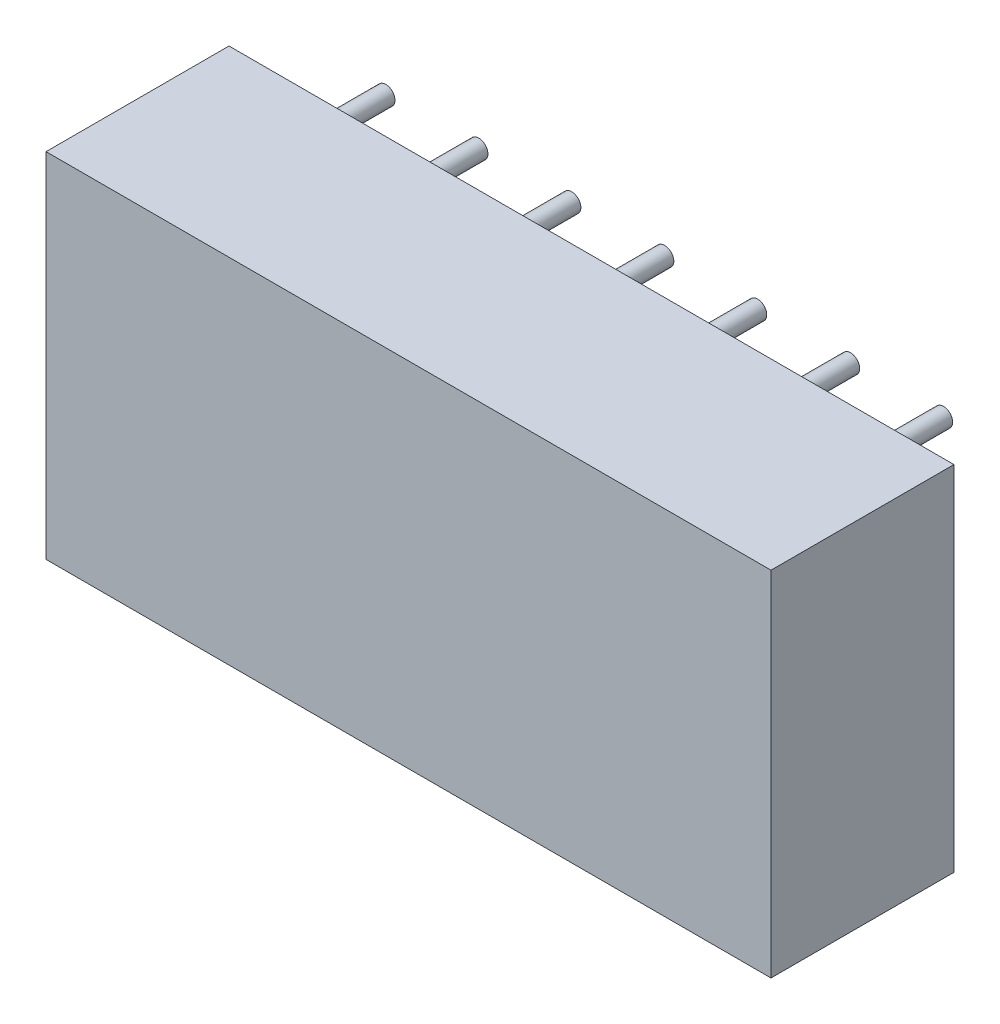
ISO-10303-21;
HEADER;
FILE_DESCRIPTION(('STEP AP214'),'2;1');
FILE_NAME('part.step','',(''),(''),'','','');
FILE_SCHEMA(('AUTOMOTIVE_DESIGN { 1 0 10303 214 1 1 1 1 }'));
ENDSEC;
DATA;
#1=APPLICATION_CONTEXT('core data for automotive mechanical design processes');
#2=APPLICATION_PROTOCOL_DEFINITION('international standard','automotive_design',2000,#1);
#3=PRODUCT_CONTEXT('',#1,'mechanical');
#4=PRODUCT('Part','Part','',(#3));
#5=PRODUCT_RELATED_PRODUCT_CATEGORY('part','',(#4));
#6=PRODUCT_DEFINITION_FORMATION('','',#4);
#7=PRODUCT_DEFINITION_CONTEXT('part definition',#1,'design');
#8=PRODUCT_DEFINITION('design','',#6,#7);
#9=PRODUCT_DEFINITION_SHAPE('','',#8);
#10=(LENGTH_UNIT() NAMED_UNIT(*) SI_UNIT(.MILLI.,.METRE.));
#11=(NAMED_UNIT(*) PLANE_ANGLE_UNIT() SI_UNIT($,.RADIAN.));
#12=(NAMED_UNIT(*) SI_UNIT($,.STERADIAN.) SOLID_ANGLE_UNIT());
#13=UNCERTAINTY_MEASURE_WITH_UNIT(LENGTH_MEASURE(1.E-05),#10,'distance_accuracy_value','');
#14=(GEOMETRIC_REPRESENTATION_CONTEXT(3) GLOBAL_UNCERTAINTY_ASSIGNED_CONTEXT((#13)) GLOBAL_UNIT_ASSIGNED_CONTEXT((#10,
#11,#12)) REPRESENTATION_CONTEXT('',''));
#15=CARTESIAN_POINT('',(0.,0.,0.));
#16=DIRECTION('',(0.,0.,1.));
#17=DIRECTION('',(1.,0.,0.));
#18=AXIS2_PLACEMENT_3D('',#15,#16,#17);
#19=CARTESIAN_POINT('',(0.,7.62,-2.));
#20=DIRECTION('',(0.,0.,1.));
#21=DIRECTION('',(1.,0.,0.));
#22=AXIS2_PLACEMENT_3D('',#19,#20,#21);
#23=CYLINDRICAL_SURFACE('',#22,0.25);
#24=CARTESIAN_POINT('',(0.,7.62,-2.));
#25=DIRECTION('',(0.,0.,1.));
#26=DIRECTION('',(1.,0.,0.));
#27=AXIS2_PLACEMENT_3D('',#24,#25,#26);
#28=CIRCLE('',#27,0.25);
#29=CARTESIAN_POINT('',(0.25,7.62,-2.));
#30=VERTEX_POINT('',#29);
#31=EDGE_CURVE('E11',#30,#30,#28,.T.);
#32=ORIENTED_EDGE('',*,*,#31,.T.);
#33=EDGE_LOOP('',(#32));
#34=FACE_BOUND('',#33,.T.);
#35=CARTESIAN_POINT('',(0.,7.62,0.));
#36=DIRECTION('',(0.,0.,1.));
#37=DIRECTION('',(1.,0.,0.));
#38=AXIS2_PLACEMENT_3D('',#35,#36,#37);
#39=CIRCLE('',#38,0.25);
#40=CARTESIAN_POINT('',(0.25,7.62,0.));
#41=VERTEX_POINT('',#40);
#42=EDGE_CURVE('E43',#41,#41,#39,.T.);
#43=ORIENTED_EDGE('',*,*,#42,.F.);
#44=EDGE_LOOP('',(#43));
#45=FACE_BOUND('',#44,.T.);
#46=ADVANCED_FACE('F40',(#34,#45),#23,.T.);
#47=CARTESIAN_POINT('',(0.,7.62,-2.));
#48=DIRECTION('',(0.,0.,1.));
#49=DIRECTION('',(1.,0.,0.));
#50=AXIS2_PLACEMENT_3D('',#47,#48,#49);
#51=PLANE('',#50);
#52=ORIENTED_EDGE('',*,*,#31,.F.);
#53=EDGE_LOOP('',(#52));
#54=FACE_BOUND('',#53,.T.);
#55=ADVANCED_FACE('F55',(#54),#51,.F.);
#56=CARTESIAN_POINT('',(0.,7.62,0.));
#57=DIRECTION('',(0.,0.,1.));
#58=DIRECTION('',(1.,0.,0.));
#59=AXIS2_PLACEMENT_3D('',#56,#57,#58);
#60=PLANE('',#59);
#61=ORIENTED_EDGE('',*,*,#42,.T.);
#62=EDGE_LOOP('',(#61));
#63=FACE_BOUND('',#62,.T.);
#64=ADVANCED_FACE('F52',(#63),#60,.T.);
#65=CLOSED_SHELL('',(#46,#55,#64));
#66=MANIFOLD_SOLID_BREP('B2',#65);
#67=CARTESIAN_POINT('',(2.54,7.62,-2.));
#68=DIRECTION('',(0.,0.,1.));
#69=DIRECTION('',(1.,0.,0.));
#70=AXIS2_PLACEMENT_3D('',#67,#68,#69);
#71=CYLINDRICAL_SURFACE('',#70,0.25);
#72=CARTESIAN_POINT('',(2.54,7.62,-2.));
#73=DIRECTION('',(0.,0.,1.));
#74=DIRECTION('',(1.,0.,0.));
#75=AXIS2_PLACEMENT_3D('',#72,#73,#74);
#76=CIRCLE('',#75,0.25);
#77=CARTESIAN_POINT('',(2.79,7.62,-2.));
#78=VERTEX_POINT('',#77);
#79=EDGE_CURVE('E39',#78,#78,#76,.T.);
#80=ORIENTED_EDGE('',*,*,#79,.T.);
#81=EDGE_LOOP('',(#80));
#82=FACE_BOUND('',#81,.T.);
#83=CARTESIAN_POINT('',(2.54,7.62,0.));
#84=DIRECTION('',(0.,0.,1.));
#85=DIRECTION('',(1.,0.,0.));
#86=AXIS2_PLACEMENT_3D('',#83,#84,#85);
#87=CIRCLE('',#86,0.25);
#88=CARTESIAN_POINT('',(2.79,7.62,0.));
#89=VERTEX_POINT('',#88);
#90=EDGE_CURVE('E92',#89,#89,#87,.T.);
#91=ORIENTED_EDGE('',*,*,#90,.F.);
#92=EDGE_LOOP('',(#91));
#93=FACE_BOUND('',#92,.T.);
#94=ADVANCED_FACE('F89',(#82,#93),#71,.T.);
#95=CARTESIAN_POINT('',(2.54,7.62,-2.));
#96=DIRECTION('',(0.,0.,1.));
#97=DIRECTION('',(1.,0.,0.));
#98=AXIS2_PLACEMENT_3D('',#95,#96,#97);
#99=PLANE('',#98);
#100=ORIENTED_EDGE('',*,*,#79,.F.);
#101=EDGE_LOOP('',(#100));
#102=FACE_BOUND('',#101,.T.);
#103=ADVANCED_FACE('F104',(#102),#99,.F.);
#104=CARTESIAN_POINT('',(2.54,7.62,0.));
#105=DIRECTION('',(0.,0.,1.));
#106=DIRECTION('',(1.,0.,0.));
#107=AXIS2_PLACEMENT_3D('',#104,#105,#106);
#108=PLANE('',#107);
#109=ORIENTED_EDGE('',*,*,#90,.T.);
#110=EDGE_LOOP('',(#109));
#111=FACE_BOUND('',#110,.T.);
#112=ADVANCED_FACE('F101',(#111),#108,.T.);
#113=CLOSED_SHELL('',(#94,#103,#112));
#114=MANIFOLD_SOLID_BREP('B6',#113);
#115=CARTESIAN_POINT('',(5.08,7.62,-2.));
#116=DIRECTION('',(0.,0.,1.));
#117=DIRECTION('',(1.,0.,0.));
#118=AXIS2_PLACEMENT_3D('',#115,#116,#117);
#119=CYLINDRICAL_SURFACE('',#118,0.25);
#120=CARTESIAN_POINT('',(5.08,7.62,-2.));
#121=DIRECTION('',(0.,0.,1.));
#122=DIRECTION('',(1.,0.,0.));
#123=AXIS2_PLACEMENT_3D('',#120,#121,#122);
#124=CIRCLE('',#123,0.25);
#125=CARTESIAN_POINT('',(5.33,7.62,-2.));
#126=VERTEX_POINT('',#125);
#127=EDGE_CURVE('E88',#126,#126,#124,.T.);
#128=ORIENTED_EDGE('',*,*,#127,.T.);
#129=EDGE_LOOP('',(#128));
#130=FACE_BOUND('',#129,.T.);
#131=CARTESIAN_POINT('',(5.08,7.62,0.));
#132=DIRECTION('',(0.,0.,1.));
#133=DIRECTION('',(1.,0.,0.));
#134=AXIS2_PLACEMENT_3D('',#131,#132,#133);
#135=CIRCLE('',#134,0.25);
#136=CARTESIAN_POINT('',(5.33,7.62,0.));
#137=VERTEX_POINT('',#136);
#138=EDGE_CURVE('E141',#137,#137,#135,.T.);
#139=ORIENTED_EDGE('',*,*,#138,.F.);
#140=EDGE_LOOP('',(#139));
#141=FACE_BOUND('',#140,.T.);
#142=ADVANCED_FACE('F138',(#130,#141),#119,.T.);
#143=CARTESIAN_POINT('',(5.08,7.62,-2.));
#144=DIRECTION('',(0.,0.,1.));
#145=DIRECTION('',(1.,0.,0.));
#146=AXIS2_PLACEMENT_3D('',#143,#144,#145);
#147=PLANE('',#146);
#148=ORIENTED_EDGE('',*,*,#127,.F.);
#149=EDGE_LOOP('',(#148));
#150=FACE_BOUND('',#149,.T.);
#151=ADVANCED_FACE('F153',(#150),#147,.F.);
#152=CARTESIAN_POINT('',(5.08,7.62,0.));
#153=DIRECTION('',(0.,0.,1.));
#154=DIRECTION('',(1.,0.,0.));
#155=AXIS2_PLACEMENT_3D('',#152,#153,#154);
#156=PLANE('',#155);
#157=ORIENTED_EDGE('',*,*,#138,.T.);
#158=EDGE_LOOP('',(#157));
#159=FACE_BOUND('',#158,.T.);
#160=ADVANCED_FACE('F150',(#159),#156,.T.);
#161=CLOSED_SHELL('',(#142,#151,#160));
#162=MANIFOLD_SOLID_BREP('B34',#161);
#163=CARTESIAN_POINT('',(7.62,7.62,-2.));
#164=DIRECTION('',(0.,0.,1.));
#165=DIRECTION('',(1.,0.,0.));
#166=AXIS2_PLACEMENT_3D('',#163,#164,#165);
#167=CYLINDRICAL_SURFACE('',#166,0.25);
#168=CARTESIAN_POINT('',(7.62,7.62,-2.));
#169=DIRECTION('',(0.,0.,1.));
#170=DIRECTION('',(1.,0.,0.));
#171=AXIS2_PLACEMENT_3D('',#168,#169,#170);
#172=CIRCLE('',#171,0.25);
#173=CARTESIAN_POINT('',(7.87,7.62,-2.));
#174=VERTEX_POINT('',#173);
#175=EDGE_CURVE('E137',#174,#174,#172,.T.);
#176=ORIENTED_EDGE('',*,*,#175,.T.);
#177=EDGE_LOOP('',(#176));
#178=FACE_BOUND('',#177,.T.);
#179=CARTESIAN_POINT('',(7.62,7.62,0.));
#180=DIRECTION('',(0.,0.,1.));
#181=DIRECTION('',(1.,0.,0.));
#182=AXIS2_PLACEMENT_3D('',#179,#180,#181);
#183=CIRCLE('',#182,0.25);
#184=CARTESIAN_POINT('',(7.87,7.62,0.));
#185=VERTEX_POINT('',#184);
#186=EDGE_CURVE('E190',#185,#185,#183,.T.);
#187=ORIENTED_EDGE('',*,*,#186,.F.);
#188=EDGE_LOOP('',(#187));
#189=FACE_BOUND('',#188,.T.);
#190=ADVANCED_FACE('F187',(#178,#189),#167,.T.);
#191=CARTESIAN_POINT('',(7.62,7.62,-2.));
#192=DIRECTION('',(0.,0.,1.));
#193=DIRECTION('',(1.,0.,0.));
#194=AXIS2_PLACEMENT_3D('',#191,#192,#193);
#195=PLANE('',#194);
#196=ORIENTED_EDGE('',*,*,#175,.F.);
#197=EDGE_LOOP('',(#196));
#198=FACE_BOUND('',#197,.T.);
#199=ADVANCED_FACE('F202',(#198),#195,.F.);
#200=CARTESIAN_POINT('',(7.62,7.62,0.));
#201=DIRECTION('',(0.,0.,1.));
#202=DIRECTION('',(1.,0.,0.));
#203=AXIS2_PLACEMENT_3D('',#200,#201,#202);
#204=PLANE('',#203);
#205=ORIENTED_EDGE('',*,*,#186,.T.);
#206=EDGE_LOOP('',(#205));
#207=FACE_BOUND('',#206,.T.);
#208=ADVANCED_FACE('F199',(#207),#204,.T.);
#209=CLOSED_SHELL('',(#190,#199,#208));
#210=MANIFOLD_SOLID_BREP('B83',#209);
#211=CARTESIAN_POINT('',(10.16,7.62,-2.));
#212=DIRECTION('',(0.,0.,1.));
#213=DIRECTION('',(1.,0.,0.));
#214=AXIS2_PLACEMENT_3D('',#211,#212,#213);
#215=CYLINDRICAL_SURFACE('',#214,0.25);
#216=CARTESIAN_POINT('',(10.16,7.62,-2.));
#217=DIRECTION('',(0.,0.,1.));
#218=DIRECTION('',(1.,0.,0.));
#219=AXIS2_PLACEMENT_3D('',#216,#217,#218);
#220=CIRCLE('',#219,0.25);
#221=CARTESIAN_POINT('',(10.41,7.62,-2.));
#222=VERTEX_POINT('',#221);
#223=EDGE_CURVE('E186',#222,#222,#220,.T.);
#224=ORIENTED_EDGE('',*,*,#223,.T.);
#225=EDGE_LOOP('',(#224));
#226=FACE_BOUND('',#225,.T.);
#227=CARTESIAN_POINT('',(10.16,7.62,0.));
#228=DIRECTION('',(0.,0.,1.));
#229=DIRECTION('',(1.,0.,0.));
#230=AXIS2_PLACEMENT_3D('',#227,#228,#229);
#231=CIRCLE('',#230,0.25);
#232=CARTESIAN_POINT('',(10.41,7.62,0.));
#233=VERTEX_POINT('',#232);
#234=EDGE_CURVE('E239',#233,#233,#231,.T.);
#235=ORIENTED_EDGE('',*,*,#234,.F.);
#236=EDGE_LOOP('',(#235));
#237=FACE_BOUND('',#236,.T.);
#238=ADVANCED_FACE('F236',(#226,#237),#215,.T.);
#239=CARTESIAN_POINT('',(10.16,7.62,-2.));
#240=DIRECTION('',(0.,0.,1.));
#241=DIRECTION('',(1.,0.,0.));
#242=AXIS2_PLACEMENT_3D('',#239,#240,#241);
#243=PLANE('',#242);
#244=ORIENTED_EDGE('',*,*,#223,.F.);
#245=EDGE_LOOP('',(#244));
#246=FACE_BOUND('',#245,.T.);
#247=ADVANCED_FACE('F251',(#246),#243,.F.);
#248=CARTESIAN_POINT('',(10.16,7.62,0.));
#249=DIRECTION('',(0.,0.,1.));
#250=DIRECTION('',(1.,0.,0.));
#251=AXIS2_PLACEMENT_3D('',#248,#249,#250);
#252=PLANE('',#251);
#253=ORIENTED_EDGE('',*,*,#234,.T.);
#254=EDGE_LOOP('',(#253));
#255=FACE_BOUND('',#254,.T.);
#256=ADVANCED_FACE('F248',(#255),#252,.T.);
#257=CLOSED_SHELL('',(#238,#247,#256));
#258=MANIFOLD_SOLID_BREP('B132',#257);
#259=CARTESIAN_POINT('',(12.7,7.62,-2.));
#260=DIRECTION('',(0.,0.,1.));
#261=DIRECTION('',(1.,0.,0.));
#262=AXIS2_PLACEMENT_3D('',#259,#260,#261);
#263=CYLINDRICAL_SURFACE('',#262,0.25);
#264=CARTESIAN_POINT('',(12.7,7.62,-2.));
#265=DIRECTION('',(0.,0.,1.));
#266=DIRECTION('',(1.,0.,0.));
#267=AXIS2_PLACEMENT_3D('',#264,#265,#266);
#268=CIRCLE('',#267,0.25);
#269=CARTESIAN_POINT('',(12.95,7.62,-2.));
#270=VERTEX_POINT('',#269);
#271=EDGE_CURVE('E235',#270,#270,#268,.T.);
#272=ORIENTED_EDGE('',*,*,#271,.T.);
#273=EDGE_LOOP('',(#272));
#274=FACE_BOUND('',#273,.T.);
#275=CARTESIAN_POINT('',(12.7,7.62,0.));
#276=DIRECTION('',(0.,0.,1.));
#277=DIRECTION('',(1.,0.,0.));
#278=AXIS2_PLACEMENT_3D('',#275,#276,#277);
#279=CIRCLE('',#278,0.25);
#280=CARTESIAN_POINT('',(12.95,7.62,0.));
#281=VERTEX_POINT('',#280);
#282=EDGE_CURVE('E288',#281,#281,#279,.T.);
#283=ORIENTED_EDGE('',*,*,#282,.F.);
#284=EDGE_LOOP('',(#283));
#285=FACE_BOUND('',#284,.T.);
#286=ADVANCED_FACE('F285',(#274,#285),#263,.T.);
#287=CARTESIAN_POINT('',(12.7,7.62,-2.));
#288=DIRECTION('',(0.,0.,1.));
#289=DIRECTION('',(1.,0.,0.));
#290=AXIS2_PLACEMENT_3D('',#287,#288,#289);
#291=PLANE('',#290);
#292=ORIENTED_EDGE('',*,*,#271,.F.);
#293=EDGE_LOOP('',(#292));
#294=FACE_BOUND('',#293,.T.);
#295=ADVANCED_FACE('F300',(#294),#291,.F.);
#296=CARTESIAN_POINT('',(12.7,7.62,0.));
#297=DIRECTION('',(0.,0.,1.));
#298=DIRECTION('',(1.,0.,0.));
#299=AXIS2_PLACEMENT_3D('',#296,#297,#298);
#300=PLANE('',#299);
#301=ORIENTED_EDGE('',*,*,#282,.T.);
#302=EDGE_LOOP('',(#301));
#303=FACE_BOUND('',#302,.T.);
#304=ADVANCED_FACE('F297',(#303),#300,.T.);
#305=CLOSED_SHELL('',(#286,#295,#304));
#306=MANIFOLD_SOLID_BREP('B181',#305);
#307=CARTESIAN_POINT('',(15.24,7.62,-2.));
#308=DIRECTION('',(0.,0.,1.));
#309=DIRECTION('',(1.,0.,0.));
#310=AXIS2_PLACEMENT_3D('',#307,#308,#309);
#311=CYLINDRICAL_SURFACE('',#310,0.25);
#312=CARTESIAN_POINT('',(15.24,7.62,-2.));
#313=DIRECTION('',(0.,0.,1.));
#314=DIRECTION('',(1.,0.,0.));
#315=AXIS2_PLACEMENT_3D('',#312,#313,#314);
#316=CIRCLE('',#315,0.25);
#317=CARTESIAN_POINT('',(15.49,7.62,-2.));
#318=VERTEX_POINT('',#317);
#319=EDGE_CURVE('E284',#318,#318,#316,.T.);
#320=ORIENTED_EDGE('',*,*,#319,.T.);
#321=EDGE_LOOP('',(#320));
#322=FACE_BOUND('',#321,.T.);
#323=CARTESIAN_POINT('',(15.24,7.62,0.));
#324=DIRECTION('',(0.,0.,1.));
#325=DIRECTION('',(1.,0.,0.));
#326=AXIS2_PLACEMENT_3D('',#323,#324,#325);
#327=CIRCLE('',#326,0.25);
#328=CARTESIAN_POINT('',(15.49,7.62,0.));
#329=VERTEX_POINT('',#328);
#330=EDGE_CURVE('E337',#329,#329,#327,.T.);
#331=ORIENTED_EDGE('',*,*,#330,.F.);
#332=EDGE_LOOP('',(#331));
#333=FACE_BOUND('',#332,.T.);
#334=ADVANCED_FACE('F334',(#322,#333),#311,.T.);
#335=CARTESIAN_POINT('',(15.24,7.62,-2.));
#336=DIRECTION('',(0.,0.,1.));
#337=DIRECTION('',(1.,0.,0.));
#338=AXIS2_PLACEMENT_3D('',#335,#336,#337);
#339=PLANE('',#338);
#340=ORIENTED_EDGE('',*,*,#319,.F.);
#341=EDGE_LOOP('',(#340));
#342=FACE_BOUND('',#341,.T.);
#343=ADVANCED_FACE('F349',(#342),#339,.F.);
#344=CARTESIAN_POINT('',(15.24,7.62,0.));
#345=DIRECTION('',(0.,0.,1.));
#346=DIRECTION('',(1.,0.,0.));
#347=AXIS2_PLACEMENT_3D('',#344,#345,#346);
#348=PLANE('',#347);
#349=ORIENTED_EDGE('',*,*,#330,.T.);
#350=EDGE_LOOP('',(#349));
#351=FACE_BOUND('',#350,.T.);
#352=ADVANCED_FACE('F346',(#351),#348,.T.);
#353=CLOSED_SHELL('',(#334,#343,#352));
#354=MANIFOLD_SOLID_BREP('B230',#353);
#355=CARTESIAN_POINT('',(15.24,0.,-2.));
#356=DIRECTION('',(0.,0.,1.));
#357=DIRECTION('',(1.,0.,0.));
#358=AXIS2_PLACEMENT_3D('',#355,#356,#357);
#359=CYLINDRICAL_SURFACE('',#358,0.25);
#360=CARTESIAN_POINT('',(15.24,0.,-2.));
#361=DIRECTION('',(0.,0.,1.));
#362=DIRECTION('',(1.,0.,0.));
#363=AXIS2_PLACEMENT_3D('',#360,#361,#362);
#364=CIRCLE('',#363,0.25);
#365=CARTESIAN_POINT('',(15.49,0.,-2.));
#366=VERTEX_POINT('',#365);
#367=EDGE_CURVE('E333',#366,#366,#364,.T.);
#368=ORIENTED_EDGE('',*,*,#367,.T.);
#369=EDGE_LOOP('',(#368));
#370=FACE_BOUND('',#369,.T.);
#371=CARTESIAN_POINT('',(15.24,0.,0.));
#372=DIRECTION('',(0.,0.,1.));
#373=DIRECTION('',(1.,0.,0.));
#374=AXIS2_PLACEMENT_3D('',#371,#372,#373);
#375=CIRCLE('',#374,0.25);
#376=CARTESIAN_POINT('',(15.49,0.,0.));
#377=VERTEX_POINT('',#376);
#378=EDGE_CURVE('E386',#377,#377,#375,.T.);
#379=ORIENTED_EDGE('',*,*,#378,.F.);
#380=EDGE_LOOP('',(#379));
#381=FACE_BOUND('',#380,.T.);
#382=ADVANCED_FACE('F383',(#370,#381),#359,.T.);
#383=CARTESIAN_POINT('',(15.24,0.,-2.));
#384=DIRECTION('',(0.,0.,1.));
#385=DIRECTION('',(1.,0.,0.));
#386=AXIS2_PLACEMENT_3D('',#383,#384,#385);
#387=PLANE('',#386);
#388=ORIENTED_EDGE('',*,*,#367,.F.);
#389=EDGE_LOOP('',(#388));
#390=FACE_BOUND('',#389,.T.);
#391=ADVANCED_FACE('F398',(#390),#387,.F.);
#392=CARTESIAN_POINT('',(15.24,0.,0.));
#393=DIRECTION('',(0.,0.,1.));
#394=DIRECTION('',(1.,0.,0.));
#395=AXIS2_PLACEMENT_3D('',#392,#393,#394);
#396=PLANE('',#395);
#397=ORIENTED_EDGE('',*,*,#378,.T.);
#398=EDGE_LOOP('',(#397));
#399=FACE_BOUND('',#398,.T.);
#400=ADVANCED_FACE('F395',(#399),#396,.T.);
#401=CLOSED_SHELL('',(#382,#391,#400));
#402=MANIFOLD_SOLID_BREP('B279',#401);
#403=CARTESIAN_POINT('',(12.7,0.,-2.));
#404=DIRECTION('',(0.,0.,1.));
#405=DIRECTION('',(1.,0.,0.));
#406=AXIS2_PLACEMENT_3D('',#403,#404,#405);
#407=CYLINDRICAL_SURFACE('',#406,0.25);
#408=CARTESIAN_POINT('',(12.7,0.,-2.));
#409=DIRECTION('',(0.,0.,1.));
#410=DIRECTION('',(1.,0.,0.));
#411=AXIS2_PLACEMENT_3D('',#408,#409,#410);
#412=CIRCLE('',#411,0.25);
#413=CARTESIAN_POINT('',(12.95,0.,-2.));
#414=VERTEX_POINT('',#413);
#415=EDGE_CURVE('E382',#414,#414,#412,.T.);
#416=ORIENTED_EDGE('',*,*,#415,.T.);
#417=EDGE_LOOP('',(#416));
#418=FACE_BOUND('',#417,.T.);
#419=CARTESIAN_POINT('',(12.7,0.,0.));
#420=DIRECTION('',(0.,0.,1.));
#421=DIRECTION('',(1.,0.,0.));
#422=AXIS2_PLACEMENT_3D('',#419,#420,#421);
#423=CIRCLE('',#422,0.25);
#424=CARTESIAN_POINT('',(12.95,0.,0.));
#425=VERTEX_POINT('',#424);
#426=EDGE_CURVE('E435',#425,#425,#423,.T.);
#427=ORIENTED_EDGE('',*,*,#426,.F.);
#428=EDGE_LOOP('',(#427));
#429=FACE_BOUND('',#428,.T.);
#430=ADVANCED_FACE('F432',(#418,#429),#407,.T.);
#431=CARTESIAN_POINT('',(12.7,0.,-2.));
#432=DIRECTION('',(0.,0.,1.));
#433=DIRECTION('',(1.,0.,0.));
#434=AXIS2_PLACEMENT_3D('',#431,#432,#433);
#435=PLANE('',#434);
#436=ORIENTED_EDGE('',*,*,#415,.F.);
#437=EDGE_LOOP('',(#436));
#438=FACE_BOUND('',#437,.T.);
#439=ADVANCED_FACE('F447',(#438),#435,.F.);
#440=CARTESIAN_POINT('',(12.7,0.,0.));
#441=DIRECTION('',(0.,0.,1.));
#442=DIRECTION('',(1.,0.,0.));
#443=AXIS2_PLACEMENT_3D('',#440,#441,#442);
#444=PLANE('',#443);
#445=ORIENTED_EDGE('',*,*,#426,.T.);
#446=EDGE_LOOP('',(#445));
#447=FACE_BOUND('',#446,.T.);
#448=ADVANCED_FACE('F444',(#447),#444,.T.);
#449=CLOSED_SHELL('',(#430,#439,#448));
#450=MANIFOLD_SOLID_BREP('B328',#449);
#451=CARTESIAN_POINT('',(10.16,0.,-2.));
#452=DIRECTION('',(0.,0.,1.));
#453=DIRECTION('',(1.,0.,0.));
#454=AXIS2_PLACEMENT_3D('',#451,#452,#453);
#455=CYLINDRICAL_SURFACE('',#454,0.25);
#456=CARTESIAN_POINT('',(10.16,0.,-2.));
#457=DIRECTION('',(0.,0.,1.));
#458=DIRECTION('',(1.,0.,0.));
#459=AXIS2_PLACEMENT_3D('',#456,#457,#458);
#460=CIRCLE('',#459,0.25);
#461=CARTESIAN_POINT('',(10.41,0.,-2.));
#462=VERTEX_POINT('',#461);
#463=EDGE_CURVE('E431',#462,#462,#460,.T.);
#464=ORIENTED_EDGE('',*,*,#463,.T.);
#465=EDGE_LOOP('',(#464));
#466=FACE_BOUND('',#465,.T.);
#467=CARTESIAN_POINT('',(10.16,0.,0.));
#468=DIRECTION('',(0.,0.,1.));
#469=DIRECTION('',(1.,0.,0.));
#470=AXIS2_PLACEMENT_3D('',#467,#468,#469);
#471=CIRCLE('',#470,0.25);
#472=CARTESIAN_POINT('',(10.41,0.,0.));
#473=VERTEX_POINT('',#472);
#474=EDGE_CURVE('E484',#473,#473,#471,.T.);
#475=ORIENTED_EDGE('',*,*,#474,.F.);
#476=EDGE_LOOP('',(#475));
#477=FACE_BOUND('',#476,.T.);
#478=ADVANCED_FACE('F481',(#466,#477),#455,.T.);
#479=CARTESIAN_POINT('',(10.16,0.,-2.));
#480=DIRECTION('',(0.,0.,1.));
#481=DIRECTION('',(1.,0.,0.));
#482=AXIS2_PLACEMENT_3D('',#479,#480,#481);
#483=PLANE('',#482);
#484=ORIENTED_EDGE('',*,*,#463,.F.);
#485=EDGE_LOOP('',(#484));
#486=FACE_BOUND('',#485,.T.);
#487=ADVANCED_FACE('F496',(#486),#483,.F.);
#488=CARTESIAN_POINT('',(10.16,0.,0.));
#489=DIRECTION('',(0.,0.,1.));
#490=DIRECTION('',(1.,0.,0.));
#491=AXIS2_PLACEMENT_3D('',#488,#489,#490);
#492=PLANE('',#491);
#493=ORIENTED_EDGE('',*,*,#474,.T.);
#494=EDGE_LOOP('',(#493));
#495=FACE_BOUND('',#494,.T.);
#496=ADVANCED_FACE('F493',(#495),#492,.T.);
#497=CLOSED_SHELL('',(#478,#487,#496));
#498=MANIFOLD_SOLID_BREP('B377',#497);
#499=CARTESIAN_POINT('',(7.62,0.,-2.));
#500=DIRECTION('',(0.,0.,1.));
#501=DIRECTION('',(1.,0.,0.));
#502=AXIS2_PLACEMENT_3D('',#499,#500,#501);
#503=CYLINDRICAL_SURFACE('',#502,0.25);
#504=CARTESIAN_POINT('',(7.62,0.,-2.));
#505=DIRECTION('',(0.,0.,1.));
#506=DIRECTION('',(1.,0.,0.));
#507=AXIS2_PLACEMENT_3D('',#504,#505,#506);
#508=CIRCLE('',#507,0.25);
#509=CARTESIAN_POINT('',(7.87,0.,-2.));
#510=VERTEX_POINT('',#509);
#511=EDGE_CURVE('E480',#510,#510,#508,.T.);
#512=ORIENTED_EDGE('',*,*,#511,.T.);
#513=EDGE_LOOP('',(#512));
#514=FACE_BOUND('',#513,.T.);
#515=CARTESIAN_POINT('',(7.62,0.,0.));
#516=DIRECTION('',(0.,0.,1.));
#517=DIRECTION('',(1.,0.,0.));
#518=AXIS2_PLACEMENT_3D('',#515,#516,#517);
#519=CIRCLE('',#518,0.25);
#520=CARTESIAN_POINT('',(7.87,0.,0.));
#521=VERTEX_POINT('',#520);
#522=EDGE_CURVE('E533',#521,#521,#519,.T.);
#523=ORIENTED_EDGE('',*,*,#522,.F.);
#524=EDGE_LOOP('',(#523));
#525=FACE_BOUND('',#524,.T.);
#526=ADVANCED_FACE('F530',(#514,#525),#503,.T.);
#527=CARTESIAN_POINT('',(7.62,0.,-2.));
#528=DIRECTION('',(0.,0.,1.));
#529=DIRECTION('',(1.,0.,0.));
#530=AXIS2_PLACEMENT_3D('',#527,#528,#529);
#531=PLANE('',#530);
#532=ORIENTED_EDGE('',*,*,#511,.F.);
#533=EDGE_LOOP('',(#532));
#534=FACE_BOUND('',#533,.T.);
#535=ADVANCED_FACE('F545',(#534),#531,.F.);
#536=CARTESIAN_POINT('',(7.62,0.,0.));
#537=DIRECTION('',(0.,0.,1.));
#538=DIRECTION('',(1.,0.,0.));
#539=AXIS2_PLACEMENT_3D('',#536,#537,#538);
#540=PLANE('',#539);
#541=ORIENTED_EDGE('',*,*,#522,.T.);
#542=EDGE_LOOP('',(#541));
#543=FACE_BOUND('',#542,.T.);
#544=ADVANCED_FACE('F542',(#543),#540,.T.);
#545=CLOSED_SHELL('',(#526,#535,#544));
#546=MANIFOLD_SOLID_BREP('B426',#545);
#547=CARTESIAN_POINT('',(5.08,0.,-2.));
#548=DIRECTION('',(0.,0.,1.));
#549=DIRECTION('',(1.,0.,0.));
#550=AXIS2_PLACEMENT_3D('',#547,#548,#549);
#551=CYLINDRICAL_SURFACE('',#550,0.25);
#552=CARTESIAN_POINT('',(5.08,0.,-2.));
#553=DIRECTION('',(0.,0.,1.));
#554=DIRECTION('',(1.,0.,0.));
#555=AXIS2_PLACEMENT_3D('',#552,#553,#554);
#556=CIRCLE('',#555,0.25);
#557=CARTESIAN_POINT('',(5.33,0.,-2.));
#558=VERTEX_POINT('',#557);
#559=EDGE_CURVE('E529',#558,#558,#556,.T.);
#560=ORIENTED_EDGE('',*,*,#559,.T.);
#561=EDGE_LOOP('',(#560));
#562=FACE_BOUND('',#561,.T.);
#563=CARTESIAN_POINT('',(5.08,0.,0.));
#564=DIRECTION('',(0.,0.,1.));
#565=DIRECTION('',(1.,0.,0.));
#566=AXIS2_PLACEMENT_3D('',#563,#564,#565);
#567=CIRCLE('',#566,0.25);
#568=CARTESIAN_POINT('',(5.33,0.,0.));
#569=VERTEX_POINT('',#568);
#570=EDGE_CURVE('E582',#569,#569,#567,.T.);
#571=ORIENTED_EDGE('',*,*,#570,.F.);
#572=EDGE_LOOP('',(#571));
#573=FACE_BOUND('',#572,.T.);
#574=ADVANCED_FACE('F579',(#562,#573),#551,.T.);
#575=CARTESIAN_POINT('',(5.08,0.,-2.));
#576=DIRECTION('',(0.,0.,1.));
#577=DIRECTION('',(1.,0.,0.));
#578=AXIS2_PLACEMENT_3D('',#575,#576,#577);
#579=PLANE('',#578);
#580=ORIENTED_EDGE('',*,*,#559,.F.);
#581=EDGE_LOOP('',(#580));
#582=FACE_BOUND('',#581,.T.);
#583=ADVANCED_FACE('F594',(#582),#579,.F.);
#584=CARTESIAN_POINT('',(5.08,0.,0.));
#585=DIRECTION('',(0.,0.,1.));
#586=DIRECTION('',(1.,0.,0.));
#587=AXIS2_PLACEMENT_3D('',#584,#585,#586);
#588=PLANE('',#587);
#589=ORIENTED_EDGE('',*,*,#570,.T.);
#590=EDGE_LOOP('',(#589));
#591=FACE_BOUND('',#590,.T.);
#592=ADVANCED_FACE('F591',(#591),#588,.T.);
#593=CLOSED_SHELL('',(#574,#583,#592));
#594=MANIFOLD_SOLID_BREP('B475',#593);
#595=CARTESIAN_POINT('',(2.54,0.,-2.));
#596=DIRECTION('',(0.,0.,1.));
#597=DIRECTION('',(1.,0.,0.));
#598=AXIS2_PLACEMENT_3D('',#595,#596,#597);
#599=CYLINDRICAL_SURFACE('',#598,0.25);
#600=CARTESIAN_POINT('',(2.54,0.,-2.));
#601=DIRECTION('',(0.,0.,1.));
#602=DIRECTION('',(1.,0.,0.));
#603=AXIS2_PLACEMENT_3D('',#600,#601,#602);
#604=CIRCLE('',#603,0.25);
#605=CARTESIAN_POINT('',(2.79,0.,-2.));
#606=VERTEX_POINT('',#605);
#607=EDGE_CURVE('E578',#606,#606,#604,.T.);
#608=ORIENTED_EDGE('',*,*,#607,.T.);
#609=EDGE_LOOP('',(#608));
#610=FACE_BOUND('',#609,.T.);
#611=CARTESIAN_POINT('',(2.54,0.,0.));
#612=DIRECTION('',(0.,0.,1.));
#613=DIRECTION('',(1.,0.,0.));
#614=AXIS2_PLACEMENT_3D('',#611,#612,#613);
#615=CIRCLE('',#614,0.25);
#616=CARTESIAN_POINT('',(2.79,0.,0.));
#617=VERTEX_POINT('',#616);
#618=EDGE_CURVE('E631',#617,#617,#615,.T.);
#619=ORIENTED_EDGE('',*,*,#618,.F.);
#620=EDGE_LOOP('',(#619));
#621=FACE_BOUND('',#620,.T.);
#622=ADVANCED_FACE('F628',(#610,#621),#599,.T.);
#623=CARTESIAN_POINT('',(2.54,0.,-2.));
#624=DIRECTION('',(0.,0.,1.));
#625=DIRECTION('',(1.,0.,0.));
#626=AXIS2_PLACEMENT_3D('',#623,#624,#625);
#627=PLANE('',#626);
#628=ORIENTED_EDGE('',*,*,#607,.F.);
#629=EDGE_LOOP('',(#628));
#630=FACE_BOUND('',#629,.T.);
#631=ADVANCED_FACE('F643',(#630),#627,.F.);
#632=CARTESIAN_POINT('',(2.54,0.,0.));
#633=DIRECTION('',(0.,0.,1.));
#634=DIRECTION('',(1.,0.,0.));
#635=AXIS2_PLACEMENT_3D('',#632,#633,#634);
#636=PLANE('',#635);
#637=ORIENTED_EDGE('',*,*,#618,.T.);
#638=EDGE_LOOP('',(#637));
#639=FACE_BOUND('',#638,.T.);
#640=ADVANCED_FACE('F640',(#639),#636,.T.);
#641=CLOSED_SHELL('',(#622,#631,#640));
#642=MANIFOLD_SOLID_BREP('B524',#641);
#643=CARTESIAN_POINT('',(0.,0.,-2.));
#644=DIRECTION('',(0.,0.,1.));
#645=DIRECTION('',(1.,0.,0.));
#646=AXIS2_PLACEMENT_3D('',#643,#644,#645);
#647=CYLINDRICAL_SURFACE('',#646,0.25);
#648=CARTESIAN_POINT('',(0.,0.,-2.));
#649=DIRECTION('',(0.,0.,1.));
#650=DIRECTION('',(1.,0.,0.));
#651=AXIS2_PLACEMENT_3D('',#648,#649,#650);
#652=CIRCLE('',#651,0.25);
#653=CARTESIAN_POINT('',(0.25,0.,-2.));
#654=VERTEX_POINT('',#653);
#655=EDGE_CURVE('E627',#654,#654,#652,.T.);
#656=ORIENTED_EDGE('',*,*,#655,.T.);
#657=EDGE_LOOP('',(#656));
#658=FACE_BOUND('',#657,.T.);
#659=CARTESIAN_POINT('',(0.,0.,0.));
#660=DIRECTION('',(0.,0.,1.));
#661=DIRECTION('',(1.,0.,0.));
#662=AXIS2_PLACEMENT_3D('',#659,#660,#661);
#663=CIRCLE('',#662,0.25);
#664=CARTESIAN_POINT('',(0.25,0.,0.));
#665=VERTEX_POINT('',#664);
#666=EDGE_CURVE('E681',#665,#665,#663,.T.);
#667=ORIENTED_EDGE('',*,*,#666,.F.);
#668=EDGE_LOOP('',(#667));
#669=FACE_BOUND('',#668,.T.);
#670=ADVANCED_FACE('F678',(#658,#669),#647,.T.);
#671=CARTESIAN_POINT('',(0.,0.,-2.));
#672=DIRECTION('',(0.,0.,1.));
#673=DIRECTION('',(1.,0.,0.));
#674=AXIS2_PLACEMENT_3D('',#671,#672,#673);
#675=PLANE('',#674);
#676=ORIENTED_EDGE('',*,*,#655,.F.);
#677=EDGE_LOOP('',(#676));
#678=FACE_BOUND('',#677,.T.);
#679=ADVANCED_FACE('F693',(#678),#675,.F.);
#680=CARTESIAN_POINT('',(0.,0.,0.));
#681=DIRECTION('',(0.,0.,1.));
#682=DIRECTION('',(1.,0.,0.));
#683=AXIS2_PLACEMENT_3D('',#680,#681,#682);
#684=PLANE('',#683);
#685=ORIENTED_EDGE('',*,*,#666,.T.);
#686=EDGE_LOOP('',(#685));
#687=FACE_BOUND('',#686,.T.);
#688=ADVANCED_FACE('F690',(#687),#684,.T.);
#689=CLOSED_SHELL('',(#670,#679,#688));
#690=MANIFOLD_SOLID_BREP('B573',#689);
#691=CARTESIAN_POINT('',(17.526,8.636,5.));
#692=DIRECTION('',(0.,-1.,0.));
#693=DIRECTION('',(0.,0.,-1.));
#694=AXIS2_PLACEMENT_3D('',#691,#692,#693);
#695=PLANE('',#694);
#696=DIRECTION('',(-1.,0.,0.));
#697=VECTOR('',#696,1.);
#698=CARTESIAN_POINT('',(17.526,8.636,0.));
#699=LINE('',#698,#697);
#700=CARTESIAN_POINT('',(17.526,8.636,0.));
#701=VERTEX_POINT('',#700);
#702=CARTESIAN_POINT('',(-2.286,8.636,0.));
#703=VERTEX_POINT('',#702);
#704=EDGE_CURVE('E782',#701,#703,#699,.T.);
#705=ORIENTED_EDGE('',*,*,#704,.T.);
#706=DIRECTION('',(0.,0.,-1.));
#707=VECTOR('',#706,1.);
#708=CARTESIAN_POINT('',(-2.286,8.636,5.));
#709=LINE('',#708,#707);
#710=CARTESIAN_POINT('',(-2.286,8.636,5.));
#711=VERTEX_POINT('',#710);
#712=EDGE_CURVE('E676',#711,#703,#709,.T.);
#713=ORIENTED_EDGE('',*,*,#712,.F.);
#714=DIRECTION('',(-1.,0.,0.));
#715=VECTOR('',#714,1.);
#716=CARTESIAN_POINT('',(17.526,8.636,5.));
#717=LINE('',#716,#715);
#718=CARTESIAN_POINT('',(17.526,8.636,5.));
#719=VERTEX_POINT('',#718);
#720=EDGE_CURVE('E770',#719,#711,#717,.T.);
#721=ORIENTED_EDGE('',*,*,#720,.F.);
#722=DIRECTION('',(0.,0.,-1.));
#723=VECTOR('',#722,1.);
#724=CARTESIAN_POINT('',(17.526,8.636,5.));
#725=LINE('',#724,#723);
#726=EDGE_CURVE('E778',#719,#701,#725,.T.);
#727=ORIENTED_EDGE('',*,*,#726,.T.);
#728=EDGE_LOOP('',(#705,#713,#721,#727));
#729=FACE_BOUND('',#728,.T.);
#730=ADVANCED_FACE('F719',(#729),#695,.F.);
#731=CARTESIAN_POINT('',(-2.286,8.636,5.));
#732=DIRECTION('',(1.,0.,0.));
#733=DIRECTION('',(0.,0.,-1.));
#734=AXIS2_PLACEMENT_3D('',#731,#732,#733);
#735=PLANE('',#734);
#736=DIRECTION('',(0.,-1.,0.));
#737=VECTOR('',#736,1.);
#738=CARTESIAN_POINT('',(-2.286,8.636,0.));
#739=LINE('',#738,#737);
#740=CARTESIAN_POINT('',(-2.286,-1.016,0.));
#741=VERTEX_POINT('',#740);
#742=EDGE_CURVE('E774',#703,#741,#739,.T.);
#743=ORIENTED_EDGE('',*,*,#742,.T.);
#744=DIRECTION('',(0.,0.,-1.));
#745=VECTOR('',#744,1.);
#746=CARTESIAN_POINT('',(-2.286,-1.016,5.));
#747=LINE('',#746,#745);
#748=CARTESIAN_POINT('',(-2.286,-1.016,5.));
#749=VERTEX_POINT('',#748);
#750=EDGE_CURVE('E727',#749,#741,#747,.T.);
#751=ORIENTED_EDGE('',*,*,#750,.F.);
#752=DIRECTION('',(0.,-1.,0.));
#753=VECTOR('',#752,1.);
#754=CARTESIAN_POINT('',(-2.286,8.636,5.));
#755=LINE('',#754,#753);
#756=EDGE_CURVE('E765',#711,#749,#755,.T.);
#757=ORIENTED_EDGE('',*,*,#756,.F.);
#758=ORIENTED_EDGE('',*,*,#712,.T.);
#759=EDGE_LOOP('',(#743,#751,#757,#758));
#760=FACE_BOUND('',#759,.T.);
#761=ADVANCED_FACE('F773',(#760),#735,.F.);
#762=CARTESIAN_POINT('',(-2.286,-1.016,5.));
#763=DIRECTION('',(0.,1.,0.));
#764=DIRECTION('',(0.,0.,1.));
#765=AXIS2_PLACEMENT_3D('',#762,#763,#764);
#766=PLANE('',#765);
#767=DIRECTION('',(1.,0.,0.));
#768=VECTOR('',#767,1.);
#769=CARTESIAN_POINT('',(-2.286,-1.016,0.));
#770=LINE('',#769,#768);
#771=CARTESIAN_POINT('',(17.526,-1.016,0.));
#772=VERTEX_POINT('',#771);
#773=EDGE_CURVE('E752',#741,#772,#770,.T.);
#774=ORIENTED_EDGE('',*,*,#773,.T.);
#775=DIRECTION('',(0.,0.,-1.));
#776=VECTOR('',#775,1.);
#777=CARTESIAN_POINT('',(17.526,-1.016,5.));
#778=LINE('',#777,#776);
#779=CARTESIAN_POINT('',(17.526,-1.016,5.));
#780=VERTEX_POINT('',#779);
#781=EDGE_CURVE('E775',#780,#772,#778,.T.);
#782=ORIENTED_EDGE('',*,*,#781,.F.);
#783=DIRECTION('',(1.,0.,0.));
#784=VECTOR('',#783,1.);
#785=CARTESIAN_POINT('',(-2.286,-1.016,5.));
#786=LINE('',#785,#784);
#787=EDGE_CURVE('E768',#749,#780,#786,.T.);
#788=ORIENTED_EDGE('',*,*,#787,.F.);
#789=ORIENTED_EDGE('',*,*,#750,.T.);
#790=EDGE_LOOP('',(#774,#782,#788,#789));
#791=FACE_BOUND('',#790,.T.);
#792=ADVANCED_FACE('F776',(#791),#766,.F.);
#793=CARTESIAN_POINT('',(17.526,-1.016,5.));
#794=DIRECTION('',(-1.,0.,0.));
#795=DIRECTION('',(0.,0.,1.));
#796=AXIS2_PLACEMENT_3D('',#793,#794,#795);
#797=PLANE('',#796);
#798=DIRECTION('',(0.,1.,0.));
#799=VECTOR('',#798,1.);
#800=CARTESIAN_POINT('',(17.526,-1.016,0.));
#801=LINE('',#800,#799);
#802=EDGE_CURVE('E758',#772,#701,#801,.T.);
#803=ORIENTED_EDGE('',*,*,#802,.T.);
#804=ORIENTED_EDGE('',*,*,#726,.F.);
#805=DIRECTION('',(0.,1.,0.));
#806=VECTOR('',#805,1.);
#807=CARTESIAN_POINT('',(17.526,-1.016,5.));
#808=LINE('',#807,#806);
#809=EDGE_CURVE('E735',#780,#719,#808,.T.);
#810=ORIENTED_EDGE('',*,*,#809,.F.);
#811=ORIENTED_EDGE('',*,*,#781,.T.);
#812=EDGE_LOOP('',(#803,#804,#810,#811));
#813=FACE_BOUND('',#812,.T.);
#814=ADVANCED_FACE('F789',(#813),#797,.F.);
#815=CARTESIAN_POINT('',(0.,0.,5.));
#816=DIRECTION('',(0.,0.,1.));
#817=DIRECTION('',(1.,0.,0.));
#818=AXIS2_PLACEMENT_3D('',#815,#816,#817);
#819=PLANE('',#818);
#820=ORIENTED_EDGE('',*,*,#720,.T.);
#821=ORIENTED_EDGE('',*,*,#756,.T.);
#822=ORIENTED_EDGE('',*,*,#787,.T.);
#823=ORIENTED_EDGE('',*,*,#809,.T.);
#824=EDGE_LOOP('',(#820,#821,#822,#823));
#825=FACE_BOUND('',#824,.T.);
#826=ADVANCED_FACE('F766',(#825),#819,.T.);
#827=CARTESIAN_POINT('',(0.,0.,0.));
#828=DIRECTION('',(0.,0.,1.));
#829=DIRECTION('',(1.,0.,0.));
#830=AXIS2_PLACEMENT_3D('',#827,#828,#829);
#831=PLANE('',#830);
#832=ORIENTED_EDGE('',*,*,#704,.F.);
#833=ORIENTED_EDGE('',*,*,#802,.F.);
#834=ORIENTED_EDGE('',*,*,#773,.F.);
#835=ORIENTED_EDGE('',*,*,#742,.F.);
#836=EDGE_LOOP('',(#832,#833,#834,#835));
#837=FACE_BOUND('',#836,.T.);
#838=ADVANCED_FACE('F792',(#837),#831,.F.);
#839=CLOSED_SHELL('',(#730,#761,#792,#814,#826,#838));
#840=MANIFOLD_SOLID_BREP('B622',#839);
#841=ADVANCED_BREP_SHAPE_REPRESENTATION('',(#18,#66,#114,#162,#210,#258,#306,#354,#402,#450,
#498,#546,#594,#642,#690,#840),#14);
#842=SHAPE_DEFINITION_REPRESENTATION(#9,#841);
ENDSEC;
END-ISO-10303-21;
